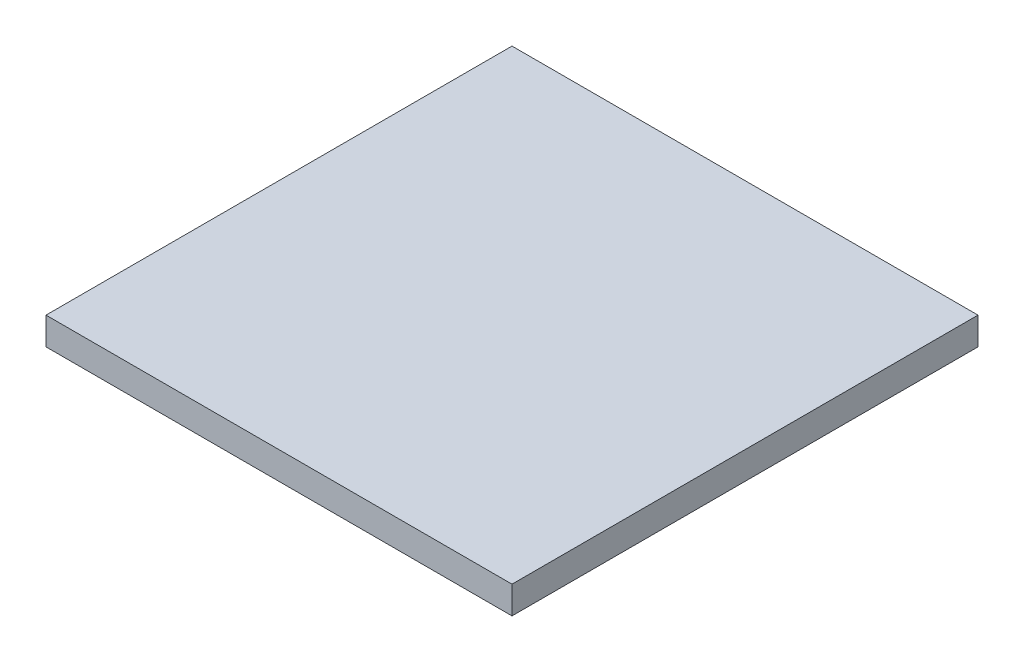
ISO-10303-21;
HEADER;
FILE_DESCRIPTION(('STEP AP214'),'2;1');
FILE_NAME('part.step','',(''),(''),'','','');
FILE_SCHEMA(('AUTOMOTIVE_DESIGN { 1 0 10303 214 1 1 1 1 }'));
ENDSEC;
DATA;
#1=APPLICATION_CONTEXT('core data for automotive mechanical design processes');
#2=APPLICATION_PROTOCOL_DEFINITION('international standard','automotive_design',2000,#1);
#3=PRODUCT_CONTEXT('',#1,'mechanical');
#4=PRODUCT('Part','Part','',(#3));
#5=PRODUCT_RELATED_PRODUCT_CATEGORY('part','',(#4));
#6=PRODUCT_DEFINITION_FORMATION('','',#4);
#7=PRODUCT_DEFINITION_CONTEXT('part definition',#1,'design');
#8=PRODUCT_DEFINITION('design','',#6,#7);
#9=PRODUCT_DEFINITION_SHAPE('','',#8);
#10=(LENGTH_UNIT() NAMED_UNIT(*) SI_UNIT(.MILLI.,.METRE.));
#11=(NAMED_UNIT(*) PLANE_ANGLE_UNIT() SI_UNIT($,.RADIAN.));
#12=(NAMED_UNIT(*) SI_UNIT($,.STERADIAN.) SOLID_ANGLE_UNIT());
#13=UNCERTAINTY_MEASURE_WITH_UNIT(LENGTH_MEASURE(1.E-05),#10,'distance_accuracy_value','');
#14=(GEOMETRIC_REPRESENTATION_CONTEXT(3) GLOBAL_UNCERTAINTY_ASSIGNED_CONTEXT((#13)) GLOBAL_UNIT_ASSIGNED_CONTEXT((#10,
#11,#12)) REPRESENTATION_CONTEXT('',''));
#15=CARTESIAN_POINT('',(0.,0.,0.));
#16=DIRECTION('',(0.,0.,1.));
#17=DIRECTION('',(1.,0.,0.));
#18=AXIS2_PLACEMENT_3D('',#15,#16,#17);
#19=CARTESIAN_POINT('',(12.7,1.5,12.7));
#20=DIRECTION('',(-1.,0.,0.));
#21=DIRECTION('',(0.,0.,1.));
#22=AXIS2_PLACEMENT_3D('',#19,#20,#21);
#23=PLANE('',#22);
#24=DIRECTION('',(0.,0.,-1.));
#25=VECTOR('',#24,1.);
#26=CARTESIAN_POINT('',(12.7,0.,12.7));
#27=LINE('',#26,#25);
#28=CARTESIAN_POINT('',(12.7,0.,12.7));
#29=VERTEX_POINT('',#28);
#30=CARTESIAN_POINT('',(12.7,0.,-12.7));
#31=VERTEX_POINT('',#30);
#32=EDGE_CURVE('E98',#29,#31,#27,.T.);
#33=ORIENTED_EDGE('',*,*,#32,.T.);
#34=DIRECTION('',(0.,-1.,0.));
#35=VECTOR('',#34,1.);
#36=CARTESIAN_POINT('',(12.7,1.5,-12.7));
#37=LINE('',#36,#35);
#38=CARTESIAN_POINT('',(12.7,1.5,-12.7));
#39=VERTEX_POINT('',#38);
#40=EDGE_CURVE('E11',#39,#31,#37,.T.);
#41=ORIENTED_EDGE('',*,*,#40,.F.);
#42=DIRECTION('',(0.,0.,-1.));
#43=VECTOR('',#42,1.);
#44=CARTESIAN_POINT('',(12.7,1.5,12.7));
#45=LINE('',#44,#43);
#46=CARTESIAN_POINT('',(12.7,1.5,12.7));
#47=VERTEX_POINT('',#46);
#48=EDGE_CURVE('E86',#47,#39,#45,.T.);
#49=ORIENTED_EDGE('',*,*,#48,.F.);
#50=DIRECTION('',(0.,-1.,0.));
#51=VECTOR('',#50,1.);
#52=CARTESIAN_POINT('',(12.7,1.5,12.7));
#53=LINE('',#52,#51);
#54=EDGE_CURVE('E94',#47,#29,#53,.T.);
#55=ORIENTED_EDGE('',*,*,#54,.T.);
#56=EDGE_LOOP('',(#33,#41,#49,#55));
#57=FACE_BOUND('',#56,.T.);
#58=ADVANCED_FACE('F35',(#57),#23,.F.);
#59=CARTESIAN_POINT('',(-12.7,1.5,-12.7));
#60=DIRECTION('',(0.,0.,1.));
#61=DIRECTION('',(1.,0.,0.));
#62=AXIS2_PLACEMENT_3D('',#59,#60,#61);
#63=PLANE('',#62);
#64=DIRECTION('',(-1.,0.,0.));
#65=VECTOR('',#64,1.);
#66=CARTESIAN_POINT('',(-12.7,0.,-12.7));
#67=LINE('',#66,#65);
#68=CARTESIAN_POINT('',(-12.7,0.,-12.7));
#69=VERTEX_POINT('',#68);
#70=EDGE_CURVE('E90',#31,#69,#67,.T.);
#71=ORIENTED_EDGE('',*,*,#70,.T.);
#72=DIRECTION('',(0.,-1.,0.));
#73=VECTOR('',#72,1.);
#74=CARTESIAN_POINT('',(-12.7,1.5,-12.7));
#75=LINE('',#74,#73);
#76=CARTESIAN_POINT('',(-12.7,1.5,-12.7));
#77=VERTEX_POINT('',#76);
#78=EDGE_CURVE('E43',#77,#69,#75,.T.);
#79=ORIENTED_EDGE('',*,*,#78,.F.);
#80=DIRECTION('',(-1.,0.,0.));
#81=VECTOR('',#80,1.);
#82=CARTESIAN_POINT('',(-12.7,1.5,-12.7));
#83=LINE('',#82,#81);
#84=EDGE_CURVE('E81',#39,#77,#83,.T.);
#85=ORIENTED_EDGE('',*,*,#84,.F.);
#86=ORIENTED_EDGE('',*,*,#40,.T.);
#87=EDGE_LOOP('',(#71,#79,#85,#86));
#88=FACE_BOUND('',#87,.T.);
#89=ADVANCED_FACE('F89',(#88),#63,.F.);
#90=CARTESIAN_POINT('',(-12.7,1.5,12.7));
#91=DIRECTION('',(1.,0.,0.));
#92=DIRECTION('',(0.,0.,-1.));
#93=AXIS2_PLACEMENT_3D('',#90,#91,#92);
#94=PLANE('',#93);
#95=DIRECTION('',(0.,0.,1.));
#96=VECTOR('',#95,1.);
#97=CARTESIAN_POINT('',(-12.7,0.,12.7));
#98=LINE('',#97,#96);
#99=CARTESIAN_POINT('',(-12.7,0.,12.7));
#100=VERTEX_POINT('',#99);
#101=EDGE_CURVE('E68',#69,#100,#98,.T.);
#102=ORIENTED_EDGE('',*,*,#101,.T.);
#103=DIRECTION('',(0.,-1.,0.));
#104=VECTOR('',#103,1.);
#105=CARTESIAN_POINT('',(-12.7,1.5,12.7));
#106=LINE('',#105,#104);
#107=CARTESIAN_POINT('',(-12.7,1.5,12.7));
#108=VERTEX_POINT('',#107);
#109=EDGE_CURVE('E91',#108,#100,#106,.T.);
#110=ORIENTED_EDGE('',*,*,#109,.F.);
#111=DIRECTION('',(0.,0.,1.));
#112=VECTOR('',#111,1.);
#113=CARTESIAN_POINT('',(-12.7,1.5,12.7));
#114=LINE('',#113,#112);
#115=EDGE_CURVE('E84',#77,#108,#114,.T.);
#116=ORIENTED_EDGE('',*,*,#115,.F.);
#117=ORIENTED_EDGE('',*,*,#78,.T.);
#118=EDGE_LOOP('',(#102,#110,#116,#117));
#119=FACE_BOUND('',#118,.T.);
#120=ADVANCED_FACE('F92',(#119),#94,.F.);
#121=CARTESIAN_POINT('',(-12.7,1.5,12.7));
#122=DIRECTION('',(0.,0.,-1.));
#123=DIRECTION('',(-1.,0.,0.));
#124=AXIS2_PLACEMENT_3D('',#121,#122,#123);
#125=PLANE('',#124);
#126=DIRECTION('',(1.,0.,0.));
#127=VECTOR('',#126,1.);
#128=CARTESIAN_POINT('',(-12.7,0.,12.7));
#129=LINE('',#128,#127);
#130=EDGE_CURVE('E74',#100,#29,#129,.T.);
#131=ORIENTED_EDGE('',*,*,#130,.T.);
#132=ORIENTED_EDGE('',*,*,#54,.F.);
#133=DIRECTION('',(1.,0.,0.));
#134=VECTOR('',#133,1.);
#135=CARTESIAN_POINT('',(-12.7,1.5,12.7));
#136=LINE('',#135,#134);
#137=EDGE_CURVE('E51',#108,#47,#136,.T.);
#138=ORIENTED_EDGE('',*,*,#137,.F.);
#139=ORIENTED_EDGE('',*,*,#109,.T.);
#140=EDGE_LOOP('',(#131,#132,#138,#139));
#141=FACE_BOUND('',#140,.T.);
#142=ADVANCED_FACE('F105',(#141),#125,.F.);
#143=CARTESIAN_POINT('',(0.,1.5,0.));
#144=DIRECTION('',(0.,-1.,0.));
#145=DIRECTION('',(0.,0.,-1.));
#146=AXIS2_PLACEMENT_3D('',#143,#144,#145);
#147=PLANE('',#146);
#148=ORIENTED_EDGE('',*,*,#48,.T.);
#149=ORIENTED_EDGE('',*,*,#84,.T.);
#150=ORIENTED_EDGE('',*,*,#115,.T.);
#151=ORIENTED_EDGE('',*,*,#137,.T.);
#152=EDGE_LOOP('',(#148,#149,#150,#151));
#153=FACE_BOUND('',#152,.T.);
#154=ADVANCED_FACE('F82',(#153),#147,.F.);
#155=CARTESIAN_POINT('',(0.,0.,0.));
#156=DIRECTION('',(0.,-1.,0.));
#157=DIRECTION('',(0.,0.,-1.));
#158=AXIS2_PLACEMENT_3D('',#155,#156,#157);
#159=PLANE('',#158);
#160=ORIENTED_EDGE('',*,*,#32,.F.);
#161=ORIENTED_EDGE('',*,*,#130,.F.);
#162=ORIENTED_EDGE('',*,*,#101,.F.);
#163=ORIENTED_EDGE('',*,*,#70,.F.);
#164=EDGE_LOOP('',(#160,#161,#162,#163));
#165=FACE_BOUND('',#164,.T.);
#166=ADVANCED_FACE('F108',(#165),#159,.T.);
#167=CLOSED_SHELL('',(#58,#89,#120,#142,#154,#166));
#168=MANIFOLD_SOLID_BREP('B2',#167);
#169=ADVANCED_BREP_SHAPE_REPRESENTATION('',(#18,#168),#14);
#170=SHAPE_DEFINITION_REPRESENTATION(#9,#169);
ENDSEC;
END-ISO-10303-21;
